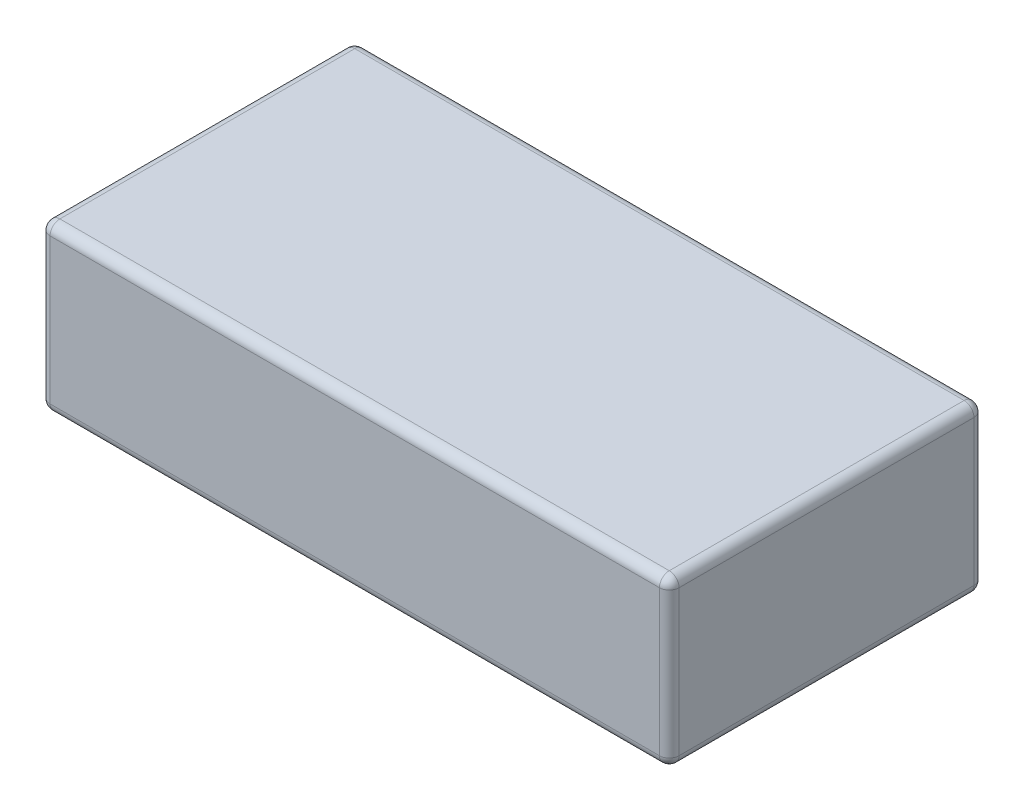
ISO-10303-21;
HEADER;
FILE_DESCRIPTION(('STEP AP214'),'2;1');
FILE_NAME('part.step','',(''),(''),'','','');
FILE_SCHEMA(('AUTOMOTIVE_DESIGN { 1 0 10303 214 1 1 1 1 }'));
ENDSEC;
DATA;
#1=APPLICATION_CONTEXT('core data for automotive mechanical design processes');
#2=APPLICATION_PROTOCOL_DEFINITION('international standard','automotive_design',2000,#1);
#3=PRODUCT_CONTEXT('',#1,'mechanical');
#4=PRODUCT('Part','Part','',(#3));
#5=PRODUCT_RELATED_PRODUCT_CATEGORY('part','',(#4));
#6=PRODUCT_DEFINITION_FORMATION('','',#4);
#7=PRODUCT_DEFINITION_CONTEXT('part definition',#1,'design');
#8=PRODUCT_DEFINITION('design','',#6,#7);
#9=PRODUCT_DEFINITION_SHAPE('','',#8);
#10=(LENGTH_UNIT() NAMED_UNIT(*) SI_UNIT(.MILLI.,.METRE.));
#11=(NAMED_UNIT(*) PLANE_ANGLE_UNIT() SI_UNIT($,.RADIAN.));
#12=(NAMED_UNIT(*) SI_UNIT($,.STERADIAN.) SOLID_ANGLE_UNIT());
#13=UNCERTAINTY_MEASURE_WITH_UNIT(LENGTH_MEASURE(1.E-05),#10,'distance_accuracy_value','');
#14=(GEOMETRIC_REPRESENTATION_CONTEXT(3) GLOBAL_UNCERTAINTY_ASSIGNED_CONTEXT((#13)) GLOBAL_UNIT_ASSIGNED_CONTEXT((#10,
#11,#12)) REPRESENTATION_CONTEXT('',''));
#15=CARTESIAN_POINT('',(0.,0.,0.));
#16=DIRECTION('',(0.,0.,1.));
#17=DIRECTION('',(1.,0.,0.));
#18=AXIS2_PLACEMENT_3D('',#15,#16,#17);
#19=CARTESIAN_POINT('',(1.55,0.05,0.75));
#20=DIRECTION('',(1.,0.,0.));
#21=DIRECTION('',(0.,0.,-1.));
#22=AXIS2_PLACEMENT_3D('',#19,#20,#21);
#23=SPHERICAL_SURFACE('',#22,0.05);
#24=CARTESIAN_POINT('',(1.55,0.05,0.75));
#25=DIRECTION('',(-1.,0.,0.));
#26=DIRECTION('',(0.,0.,1.));
#27=AXIS2_PLACEMENT_3D('',#24,#25,#26);
#28=CIRCLE('',#27,0.05);
#29=CARTESIAN_POINT('',(1.55,0.,0.75));
#30=VERTEX_POINT('',#29);
#31=CARTESIAN_POINT('',(1.55,0.049999999999988,0.8));
#32=VERTEX_POINT('',#31);
#33=EDGE_CURVE('E111',#30,#32,#28,.T.);
#34=ORIENTED_EDGE('',*,*,#33,.F.);
#35=CARTESIAN_POINT('',(1.55,0.05,0.75));
#36=DIRECTION('',(0.,0.,1.));
#37=DIRECTION('',(1.,0.,0.));
#38=AXIS2_PLACEMENT_3D('',#35,#36,#37);
#39=CIRCLE('',#38,0.05);
#40=CARTESIAN_POINT('',(1.6,0.05,0.75));
#41=VERTEX_POINT('',#40);
#42=EDGE_CURVE('E122',#41,#30,#39,.F.);
#43=ORIENTED_EDGE('',*,*,#42,.F.);
#44=CARTESIAN_POINT('',(1.55,0.05,0.75));
#45=DIRECTION('',(0.,-1.,0.));
#46=DIRECTION('',(0.,0.,-1.));
#47=AXIS2_PLACEMENT_3D('',#44,#45,#46);
#48=CIRCLE('',#47,0.05);
#49=EDGE_CURVE('E131',#32,#41,#48,.F.);
#50=ORIENTED_EDGE('',*,*,#49,.F.);
#51=EDGE_LOOP('',(#34,#43,#50));
#52=FACE_BOUND('',#51,.T.);
#53=ADVANCED_FACE('F17',(#52),#23,.T.);
#54=CARTESIAN_POINT('',(-1.55,0.05,0.75));
#55=DIRECTION('',(1.,0.,0.));
#56=DIRECTION('',(0.,0.,-1.));
#57=AXIS2_PLACEMENT_3D('',#54,#55,#56);
#58=SPHERICAL_SURFACE('',#57,0.05);
#59=CARTESIAN_POINT('',(-1.55,0.05,0.75));
#60=DIRECTION('',(0.,-1.,0.));
#61=DIRECTION('',(0.,0.,-1.));
#62=AXIS2_PLACEMENT_3D('',#59,#60,#61);
#63=CIRCLE('',#62,0.05);
#64=CARTESIAN_POINT('',(-1.6,0.05,0.75));
#65=VERTEX_POINT('',#64);
#66=CARTESIAN_POINT('',(-1.55,0.05,0.8));
#67=VERTEX_POINT('',#66);
#68=EDGE_CURVE('E261',#65,#67,#63,.F.);
#69=ORIENTED_EDGE('',*,*,#68,.F.);
#70=CARTESIAN_POINT('',(-1.55,0.05,0.75));
#71=DIRECTION('',(0.,0.,-1.));
#72=DIRECTION('',(-1.,0.,0.));
#73=AXIS2_PLACEMENT_3D('',#70,#71,#72);
#74=CIRCLE('',#73,0.05);
#75=CARTESIAN_POINT('',(-1.55,0.,0.75));
#76=VERTEX_POINT('',#75);
#77=EDGE_CURVE('E270',#76,#65,#74,.T.);
#78=ORIENTED_EDGE('',*,*,#77,.F.);
#79=CARTESIAN_POINT('',(-1.55,0.05,0.75));
#80=DIRECTION('',(-1.,0.,0.));
#81=DIRECTION('',(0.,0.,1.));
#82=AXIS2_PLACEMENT_3D('',#79,#80,#81);
#83=CIRCLE('',#82,0.05);
#84=EDGE_CURVE('E114',#67,#76,#83,.F.);
#85=ORIENTED_EDGE('',*,*,#84,.F.);
#86=EDGE_LOOP('',(#69,#78,#85));
#87=FACE_BOUND('',#86,.T.);
#88=ADVANCED_FACE('F151',(#87),#58,.T.);
#89=CARTESIAN_POINT('',(-1.55,0.05,-0.75));
#90=DIRECTION('',(1.,0.,0.));
#91=DIRECTION('',(0.,0.,-1.));
#92=AXIS2_PLACEMENT_3D('',#89,#90,#91);
#93=SPHERICAL_SURFACE('',#92,0.05);
#94=CARTESIAN_POINT('',(-1.55,0.05,-0.75));
#95=DIRECTION('',(0.,-1.,0.));
#96=DIRECTION('',(0.,0.,-1.));
#97=AXIS2_PLACEMENT_3D('',#94,#95,#96);
#98=CIRCLE('',#97,0.05);
#99=CARTESIAN_POINT('',(-1.55,0.05,-0.8));
#100=VERTEX_POINT('',#99);
#101=CARTESIAN_POINT('',(-1.6,0.05,-0.75));
#102=VERTEX_POINT('',#101);
#103=EDGE_CURVE('E256',#100,#102,#98,.F.);
#104=ORIENTED_EDGE('',*,*,#103,.F.);
#105=CARTESIAN_POINT('',(-1.55,0.05,-0.75));
#106=DIRECTION('',(1.,0.,0.));
#107=DIRECTION('',(0.,0.,-1.));
#108=AXIS2_PLACEMENT_3D('',#105,#106,#107);
#109=CIRCLE('',#108,0.05);
#110=CARTESIAN_POINT('',(-1.55,0.,-0.75));
#111=VERTEX_POINT('',#110);
#112=EDGE_CURVE('E253',#111,#100,#109,.T.);
#113=ORIENTED_EDGE('',*,*,#112,.F.);
#114=CARTESIAN_POINT('',(-1.55,0.05,-0.75));
#115=DIRECTION('',(0.,0.,-1.));
#116=DIRECTION('',(-1.,0.,0.));
#117=AXIS2_PLACEMENT_3D('',#114,#115,#116);
#118=CIRCLE('',#117,0.05);
#119=EDGE_CURVE('E267',#102,#111,#118,.F.);
#120=ORIENTED_EDGE('',*,*,#119,.F.);
#121=EDGE_LOOP('',(#104,#113,#120));
#122=FACE_BOUND('',#121,.T.);
#123=ADVANCED_FACE('F147',(#122),#93,.T.);
#124=CARTESIAN_POINT('',(1.55,0.05,-0.75));
#125=DIRECTION('',(1.,0.,0.));
#126=DIRECTION('',(0.,0.,-1.));
#127=AXIS2_PLACEMENT_3D('',#124,#125,#126);
#128=SPHERICAL_SURFACE('',#127,0.05);
#129=CARTESIAN_POINT('',(1.55,0.05,-0.75));
#130=DIRECTION('',(1.,0.,0.));
#131=DIRECTION('',(0.,0.,-1.));
#132=AXIS2_PLACEMENT_3D('',#129,#130,#131);
#133=CIRCLE('',#132,0.05);
#134=CARTESIAN_POINT('',(1.55,0.05,-0.8));
#135=VERTEX_POINT('',#134);
#136=CARTESIAN_POINT('',(1.55,0.,-0.75));
#137=VERTEX_POINT('',#136);
#138=EDGE_CURVE('E251',#135,#137,#133,.F.);
#139=ORIENTED_EDGE('',*,*,#138,.F.);
#140=CARTESIAN_POINT('',(1.55,0.05,-0.75));
#141=DIRECTION('',(0.,-1.,0.));
#142=DIRECTION('',(0.,0.,-1.));
#143=AXIS2_PLACEMENT_3D('',#140,#141,#142);
#144=CIRCLE('',#143,0.05);
#145=CARTESIAN_POINT('',(1.6,0.05,-0.75));
#146=VERTEX_POINT('',#145);
#147=EDGE_CURVE('E258',#146,#135,#144,.F.);
#148=ORIENTED_EDGE('',*,*,#147,.F.);
#149=CARTESIAN_POINT('',(1.55,0.05,-0.75));
#150=DIRECTION('',(0.,0.,1.));
#151=DIRECTION('',(1.,0.,0.));
#152=AXIS2_PLACEMENT_3D('',#149,#150,#151);
#153=CIRCLE('',#152,0.05);
#154=EDGE_CURVE('E133',#137,#146,#153,.T.);
#155=ORIENTED_EDGE('',*,*,#154,.F.);
#156=EDGE_LOOP('',(#139,#148,#155));
#157=FACE_BOUND('',#156,.T.);
#158=ADVANCED_FACE('F143',(#157),#128,.T.);
#159=CARTESIAN_POINT('',(1.55,0.05,0.8));
#160=DIRECTION('',(0.,0.,1.));
#161=DIRECTION('',(1.,0.,0.));
#162=AXIS2_PLACEMENT_3D('',#159,#160,#161);
#163=CYLINDRICAL_SURFACE('',#162,0.05);
#164=ORIENTED_EDGE('',*,*,#154,.T.);
#165=DIRECTION('',(0.,0.,1.));
#166=VECTOR('',#165,1.);
#167=CARTESIAN_POINT('',(1.6,0.05,0.8));
#168=LINE('',#167,#166);
#169=EDGE_CURVE('E127',#146,#41,#168,.T.);
#170=ORIENTED_EDGE('',*,*,#169,.T.);
#171=ORIENTED_EDGE('',*,*,#42,.T.);
#172=DIRECTION('',(0.,0.,1.));
#173=VECTOR('',#172,1.);
#174=CARTESIAN_POINT('',(1.55,0.,0.8));
#175=LINE('',#174,#173);
#176=EDGE_CURVE('E124',#30,#137,#175,.F.);
#177=ORIENTED_EDGE('',*,*,#176,.T.);
#178=EDGE_LOOP('',(#164,#170,#171,#177));
#179=FACE_BOUND('',#178,.T.);
#180=ADVANCED_FACE('F123',(#179),#163,.T.);
#181=CARTESIAN_POINT('',(1.55,0.84,0.75));
#182=DIRECTION('',(0.,-1.,0.));
#183=DIRECTION('',(0.,0.,-1.));
#184=AXIS2_PLACEMENT_3D('',#181,#182,#183);
#185=CYLINDRICAL_SURFACE('',#184,0.05);
#186=ORIENTED_EDGE('',*,*,#49,.T.);
#187=DIRECTION('',(0.,1.,0.));
#188=VECTOR('',#187,1.);
#189=CARTESIAN_POINT('',(1.6,0.84,0.75));
#190=LINE('',#189,#188);
#191=CARTESIAN_POINT('',(1.6,0.79,0.75));
#192=VERTEX_POINT('',#191);
#193=EDGE_CURVE('E247',#41,#192,#190,.T.);
#194=ORIENTED_EDGE('',*,*,#193,.T.);
#195=CARTESIAN_POINT('',(1.55,0.79,0.75));
#196=DIRECTION('',(0.,-1.,0.));
#197=DIRECTION('',(1.,0.,0.));
#198=AXIS2_PLACEMENT_3D('',#195,#196,#197);
#199=CIRCLE('',#198,0.05);
#200=CARTESIAN_POINT('',(1.55,0.79,0.8));
#201=VERTEX_POINT('',#200);
#202=EDGE_CURVE('E242',#201,#192,#199,.F.);
#203=ORIENTED_EDGE('',*,*,#202,.F.);
#204=DIRECTION('',(0.,1.,0.));
#205=VECTOR('',#204,1.);
#206=CARTESIAN_POINT('',(1.55,0.84,0.8));
#207=LINE('',#206,#205);
#208=EDGE_CURVE('E116',#201,#32,#207,.F.);
#209=ORIENTED_EDGE('',*,*,#208,.T.);
#210=EDGE_LOOP('',(#186,#194,#203,#209));
#211=FACE_BOUND('',#210,.T.);
#212=ADVANCED_FACE('F274',(#211),#185,.T.);
#213=CARTESIAN_POINT('',(-1.55,0.05,0.8));
#214=DIRECTION('',(0.,0.,-1.));
#215=DIRECTION('',(-1.,0.,0.));
#216=AXIS2_PLACEMENT_3D('',#213,#214,#215);
#217=CYLINDRICAL_SURFACE('',#216,0.05);
#218=ORIENTED_EDGE('',*,*,#119,.T.);
#219=DIRECTION('',(0.,0.,-1.));
#220=VECTOR('',#219,1.);
#221=CARTESIAN_POINT('',(-1.55,0.,0.8));
#222=LINE('',#221,#220);
#223=EDGE_CURVE('E264',#111,#76,#222,.F.);
#224=ORIENTED_EDGE('',*,*,#223,.T.);
#225=ORIENTED_EDGE('',*,*,#77,.T.);
#226=DIRECTION('',(0.,0.,-1.));
#227=VECTOR('',#226,1.);
#228=CARTESIAN_POINT('',(-1.6,0.05,0.8));
#229=LINE('',#228,#227);
#230=EDGE_CURVE('E220',#65,#102,#229,.T.);
#231=ORIENTED_EDGE('',*,*,#230,.T.);
#232=EDGE_LOOP('',(#218,#224,#225,#231));
#233=FACE_BOUND('',#232,.T.);
#234=ADVANCED_FACE('F361',(#233),#217,.T.);
#235=CARTESIAN_POINT('',(-1.55,0.84,0.75));
#236=DIRECTION('',(0.,-1.,0.));
#237=DIRECTION('',(0.,0.,-1.));
#238=AXIS2_PLACEMENT_3D('',#235,#236,#237);
#239=CYLINDRICAL_SURFACE('',#238,0.05);
#240=ORIENTED_EDGE('',*,*,#68,.T.);
#241=DIRECTION('',(0.,1.,0.));
#242=VECTOR('',#241,1.);
#243=CARTESIAN_POINT('',(-1.55,0.84,0.8));
#244=LINE('',#243,#242);
#245=CARTESIAN_POINT('',(-1.55,0.79,0.8));
#246=VERTEX_POINT('',#245);
#247=EDGE_CURVE('E241',#67,#246,#244,.T.);
#248=ORIENTED_EDGE('',*,*,#247,.T.);
#249=CARTESIAN_POINT('',(-1.55,0.79,0.75));
#250=DIRECTION('',(0.,-1.,0.));
#251=DIRECTION('',(1.,0.,0.));
#252=AXIS2_PLACEMENT_3D('',#249,#250,#251);
#253=CIRCLE('',#252,0.05);
#254=CARTESIAN_POINT('',(-1.6,0.79,0.75));
#255=VERTEX_POINT('',#254);
#256=EDGE_CURVE('E223',#255,#246,#253,.F.);
#257=ORIENTED_EDGE('',*,*,#256,.F.);
#258=DIRECTION('',(0.,1.,0.));
#259=VECTOR('',#258,1.);
#260=CARTESIAN_POINT('',(-1.6,0.84,0.75));
#261=LINE('',#260,#259);
#262=EDGE_CURVE('E214',#255,#65,#261,.F.);
#263=ORIENTED_EDGE('',*,*,#262,.T.);
#264=EDGE_LOOP('',(#240,#248,#257,#263));
#265=FACE_BOUND('',#264,.T.);
#266=ADVANCED_FACE('F359',(#265),#239,.T.);
#267=CARTESIAN_POINT('',(1.55,0.84,-0.75));
#268=DIRECTION('',(0.,-1.,0.));
#269=DIRECTION('',(0.,0.,-1.));
#270=AXIS2_PLACEMENT_3D('',#267,#268,#269);
#271=CYLINDRICAL_SURFACE('',#270,0.05);
#272=ORIENTED_EDGE('',*,*,#147,.T.);
#273=DIRECTION('',(0.,1.,0.));
#274=VECTOR('',#273,1.);
#275=CARTESIAN_POINT('',(1.55,0.84,-0.8));
#276=LINE('',#275,#274);
#277=CARTESIAN_POINT('',(1.55,0.79,-0.8));
#278=VERTEX_POINT('',#277);
#279=EDGE_CURVE('E206',#135,#278,#276,.T.);
#280=ORIENTED_EDGE('',*,*,#279,.T.);
#281=CARTESIAN_POINT('',(1.55,0.79,-0.75));
#282=DIRECTION('',(0.,1.,0.));
#283=DIRECTION('',(1.,0.,0.));
#284=AXIS2_PLACEMENT_3D('',#281,#282,#283);
#285=CIRCLE('',#284,0.05);
#286=CARTESIAN_POINT('',(1.6,0.79,-0.75));
#287=VERTEX_POINT('',#286);
#288=EDGE_CURVE('E208',#287,#278,#285,.T.);
#289=ORIENTED_EDGE('',*,*,#288,.F.);
#290=DIRECTION('',(0.,1.,0.));
#291=VECTOR('',#290,1.);
#292=CARTESIAN_POINT('',(1.6,0.84,-0.75));
#293=LINE('',#292,#291);
#294=EDGE_CURVE('E117',#287,#146,#293,.F.);
#295=ORIENTED_EDGE('',*,*,#294,.T.);
#296=EDGE_LOOP('',(#272,#280,#289,#295));
#297=FACE_BOUND('',#296,.T.);
#298=ADVANCED_FACE('F310',(#297),#271,.T.);
#299=CARTESIAN_POINT('',(-1.55,0.84,-0.75));
#300=DIRECTION('',(0.,-1.,0.));
#301=DIRECTION('',(0.,0.,-1.));
#302=AXIS2_PLACEMENT_3D('',#299,#300,#301);
#303=CYLINDRICAL_SURFACE('',#302,0.05);
#304=CARTESIAN_POINT('',(-1.55,0.79,-0.75));
#305=DIRECTION('',(0.,1.,0.));
#306=DIRECTION('',(1.,0.,0.));
#307=AXIS2_PLACEMENT_3D('',#304,#305,#306);
#308=CIRCLE('',#307,0.05);
#309=CARTESIAN_POINT('',(-1.55,0.79,-0.8));
#310=VERTEX_POINT('',#309);
#311=CARTESIAN_POINT('',(-1.6,0.79,-0.75));
#312=VERTEX_POINT('',#311);
#313=EDGE_CURVE('E210',#310,#312,#308,.T.);
#314=ORIENTED_EDGE('',*,*,#313,.F.);
#315=DIRECTION('',(0.,1.,0.));
#316=VECTOR('',#315,1.);
#317=CARTESIAN_POINT('',(-1.55,0.84,-0.8));
#318=LINE('',#317,#316);
#319=EDGE_CURVE('E300',#310,#100,#318,.F.);
#320=ORIENTED_EDGE('',*,*,#319,.T.);
#321=ORIENTED_EDGE('',*,*,#103,.T.);
#322=DIRECTION('',(0.,1.,0.));
#323=VECTOR('',#322,1.);
#324=CARTESIAN_POINT('',(-1.6,0.84,-0.75));
#325=LINE('',#324,#323);
#326=EDGE_CURVE('E217',#102,#312,#325,.T.);
#327=ORIENTED_EDGE('',*,*,#326,.T.);
#328=EDGE_LOOP('',(#314,#320,#321,#327));
#329=FACE_BOUND('',#328,.T.);
#330=ADVANCED_FACE('F351',(#329),#303,.T.);
#331=CARTESIAN_POINT('',(1.6,0.,-0.8));
#332=DIRECTION('',(0.,-1.,0.));
#333=DIRECTION('',(0.,0.,-1.));
#334=AXIS2_PLACEMENT_3D('',#331,#332,#333);
#335=PLANE('',#334);
#336=DIRECTION('',(1.,0.,0.));
#337=VECTOR('',#336,1.);
#338=CARTESIAN_POINT('',(-1.6,0.,-0.75));
#339=LINE('',#338,#337);
#340=EDGE_CURVE('E101',#137,#111,#339,.F.);
#341=ORIENTED_EDGE('',*,*,#340,.F.);
#342=ORIENTED_EDGE('',*,*,#176,.F.);
#343=DIRECTION('',(-1.,0.,0.));
#344=VECTOR('',#343,1.);
#345=CARTESIAN_POINT('',(-1.6,0.,0.75));
#346=LINE('',#345,#344);
#347=EDGE_CURVE('E107',#76,#30,#346,.F.);
#348=ORIENTED_EDGE('',*,*,#347,.F.);
#349=ORIENTED_EDGE('',*,*,#223,.F.);
#350=EDGE_LOOP('',(#341,#342,#348,#349));
#351=FACE_BOUND('',#350,.T.);
#352=ADVANCED_FACE('F135',(#351),#335,.T.);
#353=CARTESIAN_POINT('',(1.6,0.84,0.8));
#354=DIRECTION('',(-1.,0.,0.));
#355=DIRECTION('',(0.,0.,1.));
#356=AXIS2_PLACEMENT_3D('',#353,#354,#355);
#357=PLANE('',#356);
#358=DIRECTION('',(0.,0.,-1.));
#359=VECTOR('',#358,1.);
#360=CARTESIAN_POINT('',(1.6,0.79,-0.8));
#361=LINE('',#360,#359);
#362=EDGE_CURVE('E291',#192,#287,#361,.T.);
#363=ORIENTED_EDGE('',*,*,#362,.F.);
#364=ORIENTED_EDGE('',*,*,#193,.F.);
#365=ORIENTED_EDGE('',*,*,#169,.F.);
#366=ORIENTED_EDGE('',*,*,#294,.F.);
#367=EDGE_LOOP('',(#363,#364,#365,#366));
#368=FACE_BOUND('',#367,.T.);
#369=ADVANCED_FACE('F346',(#368),#357,.F.);
#370=CARTESIAN_POINT('',(-1.6,0.05,0.75));
#371=DIRECTION('',(-1.,0.,0.));
#372=DIRECTION('',(0.,0.,1.));
#373=AXIS2_PLACEMENT_3D('',#370,#371,#372);
#374=CYLINDRICAL_SURFACE('',#373,0.05);
#375=ORIENTED_EDGE('',*,*,#347,.T.);
#376=ORIENTED_EDGE('',*,*,#33,.T.);
#377=DIRECTION('',(-1.,0.,0.));
#378=VECTOR('',#377,1.);
#379=CARTESIAN_POINT('',(-1.6,0.05,0.8));
#380=LINE('',#379,#378);
#381=EDGE_CURVE('E282',#32,#67,#380,.T.);
#382=ORIENTED_EDGE('',*,*,#381,.T.);
#383=ORIENTED_EDGE('',*,*,#84,.T.);
#384=EDGE_LOOP('',(#375,#376,#382,#383));
#385=FACE_BOUND('',#384,.T.);
#386=ADVANCED_FACE('F109',(#385),#374,.T.);
#387=CARTESIAN_POINT('',(1.55,0.79,0.75));
#388=DIRECTION('',(1.,0.,0.));
#389=DIRECTION('',(0.,0.,-1.));
#390=AXIS2_PLACEMENT_3D('',#387,#388,#389);
#391=SPHERICAL_SURFACE('',#390,0.05);
#392=ORIENTED_EDGE('',*,*,#202,.T.);
#393=CARTESIAN_POINT('',(1.55,0.79,0.75));
#394=DIRECTION('',(0.,0.,-1.));
#395=DIRECTION('',(-1.,0.,0.));
#396=AXIS2_PLACEMENT_3D('',#393,#394,#395);
#397=CIRCLE('',#396,0.05);
#398=CARTESIAN_POINT('',(1.55,0.84,0.75));
#399=VERTEX_POINT('',#398);
#400=EDGE_CURVE('E297',#399,#192,#397,.T.);
#401=ORIENTED_EDGE('',*,*,#400,.F.);
#402=CARTESIAN_POINT('',(1.55,0.79,0.75));
#403=DIRECTION('',(1.,0.,0.));
#404=DIRECTION('',(0.,0.,-1.));
#405=AXIS2_PLACEMENT_3D('',#402,#403,#404);
#406=CIRCLE('',#405,0.05);
#407=EDGE_CURVE('E284',#201,#399,#406,.F.);
#408=ORIENTED_EDGE('',*,*,#407,.F.);
#409=EDGE_LOOP('',(#392,#401,#408));
#410=FACE_BOUND('',#409,.T.);
#411=ADVANCED_FACE('F232',(#410),#391,.T.);
#412=CARTESIAN_POINT('',(-1.55,0.79,0.75));
#413=DIRECTION('',(1.,0.,0.));
#414=DIRECTION('',(0.,0.,-1.));
#415=AXIS2_PLACEMENT_3D('',#412,#413,#414);
#416=SPHERICAL_SURFACE('',#415,0.05);
#417=ORIENTED_EDGE('',*,*,#256,.T.);
#418=CARTESIAN_POINT('',(-1.55,0.79,0.75));
#419=DIRECTION('',(1.,0.,0.));
#420=DIRECTION('',(0.,0.,-1.));
#421=AXIS2_PLACEMENT_3D('',#418,#419,#420);
#422=CIRCLE('',#421,0.05);
#423=CARTESIAN_POINT('',(-1.55,0.84,0.75));
#424=VERTEX_POINT('',#423);
#425=EDGE_CURVE('E288',#424,#246,#422,.T.);
#426=ORIENTED_EDGE('',*,*,#425,.F.);
#427=CARTESIAN_POINT('',(-1.55,0.79,0.75));
#428=DIRECTION('',(0.,0.,1.));
#429=DIRECTION('',(1.,0.,0.));
#430=AXIS2_PLACEMENT_3D('',#427,#428,#429);
#431=CIRCLE('',#430,0.05);
#432=EDGE_CURVE('E331',#255,#424,#431,.F.);
#433=ORIENTED_EDGE('',*,*,#432,.F.);
#434=EDGE_LOOP('',(#417,#426,#433));
#435=FACE_BOUND('',#434,.T.);
#436=ADVANCED_FACE('F228',(#435),#416,.T.);
#437=CARTESIAN_POINT('',(-1.6,0.84,0.8));
#438=DIRECTION('',(1.,0.,0.));
#439=DIRECTION('',(0.,0.,-1.));
#440=AXIS2_PLACEMENT_3D('',#437,#438,#439);
#441=PLANE('',#440);
#442=DIRECTION('',(0.,0.,1.));
#443=VECTOR('',#442,1.);
#444=CARTESIAN_POINT('',(-1.6,0.79,-0.8));
#445=LINE('',#444,#443);
#446=EDGE_CURVE('E322',#312,#255,#445,.T.);
#447=ORIENTED_EDGE('',*,*,#446,.F.);
#448=ORIENTED_EDGE('',*,*,#326,.F.);
#449=ORIENTED_EDGE('',*,*,#230,.F.);
#450=ORIENTED_EDGE('',*,*,#262,.F.);
#451=EDGE_LOOP('',(#447,#448,#449,#450));
#452=FACE_BOUND('',#451,.T.);
#453=ADVANCED_FACE('F231',(#452),#441,.F.);
#454=CARTESIAN_POINT('',(-1.55,0.79,-0.75));
#455=DIRECTION('',(1.,0.,0.));
#456=DIRECTION('',(0.,0.,-1.));
#457=AXIS2_PLACEMENT_3D('',#454,#455,#456);
#458=SPHERICAL_SURFACE('',#457,0.05);
#459=CARTESIAN_POINT('',(-1.55,0.79,-0.75));
#460=DIRECTION('',(0.,0.,1.));
#461=DIRECTION('',(1.,0.,0.));
#462=AXIS2_PLACEMENT_3D('',#459,#460,#461);
#463=CIRCLE('',#462,0.05);
#464=CARTESIAN_POINT('',(-1.55,0.84,-0.75));
#465=VERTEX_POINT('',#464);
#466=EDGE_CURVE('E328',#465,#312,#463,.T.);
#467=ORIENTED_EDGE('',*,*,#466,.F.);
#468=CARTESIAN_POINT('',(-1.55,0.79,-0.75));
#469=DIRECTION('',(-1.,0.,0.));
#470=DIRECTION('',(0.,0.,1.));
#471=AXIS2_PLACEMENT_3D('',#468,#469,#470);
#472=CIRCLE('',#471,0.05);
#473=EDGE_CURVE('E318',#310,#465,#472,.F.);
#474=ORIENTED_EDGE('',*,*,#473,.F.);
#475=ORIENTED_EDGE('',*,*,#313,.T.);
#476=EDGE_LOOP('',(#467,#474,#475));
#477=FACE_BOUND('',#476,.T.);
#478=ADVANCED_FACE('F199',(#477),#458,.T.);
#479=CARTESIAN_POINT('',(1.55,0.79,-0.75));
#480=DIRECTION('',(1.,0.,0.));
#481=DIRECTION('',(0.,0.,-1.));
#482=AXIS2_PLACEMENT_3D('',#479,#480,#481);
#483=SPHERICAL_SURFACE('',#482,0.05);
#484=CARTESIAN_POINT('',(1.55,0.79,-0.75));
#485=DIRECTION('',(0.,0.,-1.));
#486=DIRECTION('',(-1.,0.,0.));
#487=AXIS2_PLACEMENT_3D('',#484,#485,#486);
#488=CIRCLE('',#487,0.05);
#489=CARTESIAN_POINT('',(1.55,0.84,-0.75));
#490=VERTEX_POINT('',#489);
#491=EDGE_CURVE('E285',#287,#490,#488,.F.);
#492=ORIENTED_EDGE('',*,*,#491,.F.);
#493=ORIENTED_EDGE('',*,*,#288,.T.);
#494=CARTESIAN_POINT('',(1.55,0.79,-0.75));
#495=DIRECTION('',(-1.,0.,0.));
#496=DIRECTION('',(0.,0.,1.));
#497=AXIS2_PLACEMENT_3D('',#494,#495,#496);
#498=CIRCLE('',#497,0.05);
#499=EDGE_CURVE('E315',#490,#278,#498,.T.);
#500=ORIENTED_EDGE('',*,*,#499,.F.);
#501=EDGE_LOOP('',(#492,#493,#500));
#502=FACE_BOUND('',#501,.T.);
#503=ADVANCED_FACE('F194',(#502),#483,.T.);
#504=CARTESIAN_POINT('',(-1.6,0.05,-0.75));
#505=DIRECTION('',(1.,0.,0.));
#506=DIRECTION('',(0.,0.,-1.));
#507=AXIS2_PLACEMENT_3D('',#504,#505,#506);
#508=CYLINDRICAL_SURFACE('',#507,0.05);
#509=DIRECTION('',(1.,0.,0.));
#510=VECTOR('',#509,1.);
#511=CARTESIAN_POINT('',(-1.6,0.05,-0.8));
#512=LINE('',#511,#510);
#513=EDGE_CURVE('E317',#100,#135,#512,.T.);
#514=ORIENTED_EDGE('',*,*,#513,.T.);
#515=ORIENTED_EDGE('',*,*,#138,.T.);
#516=ORIENTED_EDGE('',*,*,#340,.T.);
#517=ORIENTED_EDGE('',*,*,#112,.T.);
#518=EDGE_LOOP('',(#514,#515,#516,#517));
#519=FACE_BOUND('',#518,.T.);
#520=ADVANCED_FACE('F190',(#519),#508,.T.);
#521=CARTESIAN_POINT('',(1.55,0.79,-0.8));
#522=DIRECTION('',(0.,0.,-1.));
#523=DIRECTION('',(-1.,0.,0.));
#524=AXIS2_PLACEMENT_3D('',#521,#522,#523);
#525=CYLINDRICAL_SURFACE('',#524,0.05);
#526=ORIENTED_EDGE('',*,*,#491,.T.);
#527=DIRECTION('',(0.,0.,-1.));
#528=VECTOR('',#527,1.);
#529=CARTESIAN_POINT('',(1.55,0.84,-0.8));
#530=LINE('',#529,#528);
#531=EDGE_CURVE('E320',#490,#399,#530,.F.);
#532=ORIENTED_EDGE('',*,*,#531,.T.);
#533=ORIENTED_EDGE('',*,*,#400,.T.);
#534=ORIENTED_EDGE('',*,*,#362,.T.);
#535=EDGE_LOOP('',(#526,#532,#533,#534));
#536=FACE_BOUND('',#535,.T.);
#537=ADVANCED_FACE('F186',(#536),#525,.T.);
#538=CARTESIAN_POINT('',(-1.6,0.84,0.8));
#539=DIRECTION('',(0.,0.,-1.));
#540=DIRECTION('',(-1.,0.,0.));
#541=AXIS2_PLACEMENT_3D('',#538,#539,#540);
#542=PLANE('',#541);
#543=DIRECTION('',(1.,0.,0.));
#544=VECTOR('',#543,1.);
#545=CARTESIAN_POINT('',(1.6,0.79,0.8));
#546=LINE('',#545,#544);
#547=EDGE_CURVE('E280',#246,#201,#546,.T.);
#548=ORIENTED_EDGE('',*,*,#547,.F.);
#549=ORIENTED_EDGE('',*,*,#247,.F.);
#550=ORIENTED_EDGE('',*,*,#381,.F.);
#551=ORIENTED_EDGE('',*,*,#208,.F.);
#552=EDGE_LOOP('',(#548,#549,#550,#551));
#553=FACE_BOUND('',#552,.T.);
#554=ADVANCED_FACE('F182',(#553),#542,.F.);
#555=CARTESIAN_POINT('',(-1.55,0.79,-0.8));
#556=DIRECTION('',(0.,0.,1.));
#557=DIRECTION('',(1.,0.,0.));
#558=AXIS2_PLACEMENT_3D('',#555,#556,#557);
#559=CYLINDRICAL_SURFACE('',#558,0.05);
#560=ORIENTED_EDGE('',*,*,#466,.T.);
#561=ORIENTED_EDGE('',*,*,#446,.T.);
#562=ORIENTED_EDGE('',*,*,#432,.T.);
#563=DIRECTION('',(0.,0.,-1.));
#564=VECTOR('',#563,1.);
#565=CARTESIAN_POINT('',(-1.55,0.84,-0.8));
#566=LINE('',#565,#564);
#567=EDGE_CURVE('E338',#424,#465,#566,.T.);
#568=ORIENTED_EDGE('',*,*,#567,.T.);
#569=EDGE_LOOP('',(#560,#561,#562,#568));
#570=FACE_BOUND('',#569,.T.);
#571=ADVANCED_FACE('F178',(#570),#559,.T.);
#572=CARTESIAN_POINT('',(-1.6,0.84,-0.8));
#573=DIRECTION('',(0.,0.,1.));
#574=DIRECTION('',(1.,0.,0.));
#575=AXIS2_PLACEMENT_3D('',#572,#573,#574);
#576=PLANE('',#575);
#577=ORIENTED_EDGE('',*,*,#513,.F.);
#578=ORIENTED_EDGE('',*,*,#319,.F.);
#579=DIRECTION('',(-1.,0.,0.));
#580=VECTOR('',#579,1.);
#581=CARTESIAN_POINT('',(1.6,0.79,-0.8));
#582=LINE('',#581,#580);
#583=EDGE_CURVE('E316',#278,#310,#582,.T.);
#584=ORIENTED_EDGE('',*,*,#583,.F.);
#585=ORIENTED_EDGE('',*,*,#279,.F.);
#586=EDGE_LOOP('',(#577,#578,#584,#585));
#587=FACE_BOUND('',#586,.T.);
#588=ADVANCED_FACE('F174',(#587),#576,.F.);
#589=CARTESIAN_POINT('',(1.6,0.79,0.75));
#590=DIRECTION('',(1.,0.,0.));
#591=DIRECTION('',(0.,0.,-1.));
#592=AXIS2_PLACEMENT_3D('',#589,#590,#591);
#593=CYLINDRICAL_SURFACE('',#592,0.05);
#594=ORIENTED_EDGE('',*,*,#547,.T.);
#595=ORIENTED_EDGE('',*,*,#407,.T.);
#596=DIRECTION('',(1.,0.,0.));
#597=VECTOR('',#596,1.);
#598=CARTESIAN_POINT('',(1.6,0.84,0.75));
#599=LINE('',#598,#597);
#600=EDGE_CURVE('E26',#399,#424,#599,.F.);
#601=ORIENTED_EDGE('',*,*,#600,.T.);
#602=ORIENTED_EDGE('',*,*,#425,.T.);
#603=EDGE_LOOP('',(#594,#595,#601,#602));
#604=FACE_BOUND('',#603,.T.);
#605=ADVANCED_FACE('F168',(#604),#593,.T.);
#606=CARTESIAN_POINT('',(1.6,0.79,-0.75));
#607=DIRECTION('',(-1.,0.,0.));
#608=DIRECTION('',(0.,0.,1.));
#609=AXIS2_PLACEMENT_3D('',#606,#607,#608);
#610=CYLINDRICAL_SURFACE('',#609,0.05);
#611=DIRECTION('',(1.,0.,0.));
#612=VECTOR('',#611,1.);
#613=CARTESIAN_POINT('',(1.6,0.84,-0.75));
#614=LINE('',#613,#612);
#615=EDGE_CURVE('E11',#465,#490,#614,.T.);
#616=ORIENTED_EDGE('',*,*,#615,.T.);
#617=ORIENTED_EDGE('',*,*,#499,.T.);
#618=ORIENTED_EDGE('',*,*,#583,.T.);
#619=ORIENTED_EDGE('',*,*,#473,.T.);
#620=EDGE_LOOP('',(#616,#617,#618,#619));
#621=FACE_BOUND('',#620,.T.);
#622=ADVANCED_FACE('F163',(#621),#610,.T.);
#623=CARTESIAN_POINT('',(1.6,0.84,-0.8));
#624=DIRECTION('',(0.,-1.,0.));
#625=DIRECTION('',(0.,0.,-1.));
#626=AXIS2_PLACEMENT_3D('',#623,#624,#625);
#627=PLANE('',#626);
#628=ORIENTED_EDGE('',*,*,#615,.F.);
#629=ORIENTED_EDGE('',*,*,#567,.F.);
#630=ORIENTED_EDGE('',*,*,#600,.F.);
#631=ORIENTED_EDGE('',*,*,#531,.F.);
#632=EDGE_LOOP('',(#628,#629,#630,#631));
#633=FACE_BOUND('',#632,.T.);
#634=ADVANCED_FACE('F161',(#633),#627,.F.);
#635=CLOSED_SHELL('',(#53,#88,#123,#158,#180,#212,#234,#266,#298,#330,#352,#369,#386,#411,#436,
#453,#478,#503,#520,#537,#554,#571,#588,#605,#622,#634));
#636=MANIFOLD_SOLID_BREP('B1',#635);
#637=ADVANCED_BREP_SHAPE_REPRESENTATION('',(#18,#636),#14);
#638=SHAPE_DEFINITION_REPRESENTATION(#9,#637);
ENDSEC;
END-ISO-10303-21;
